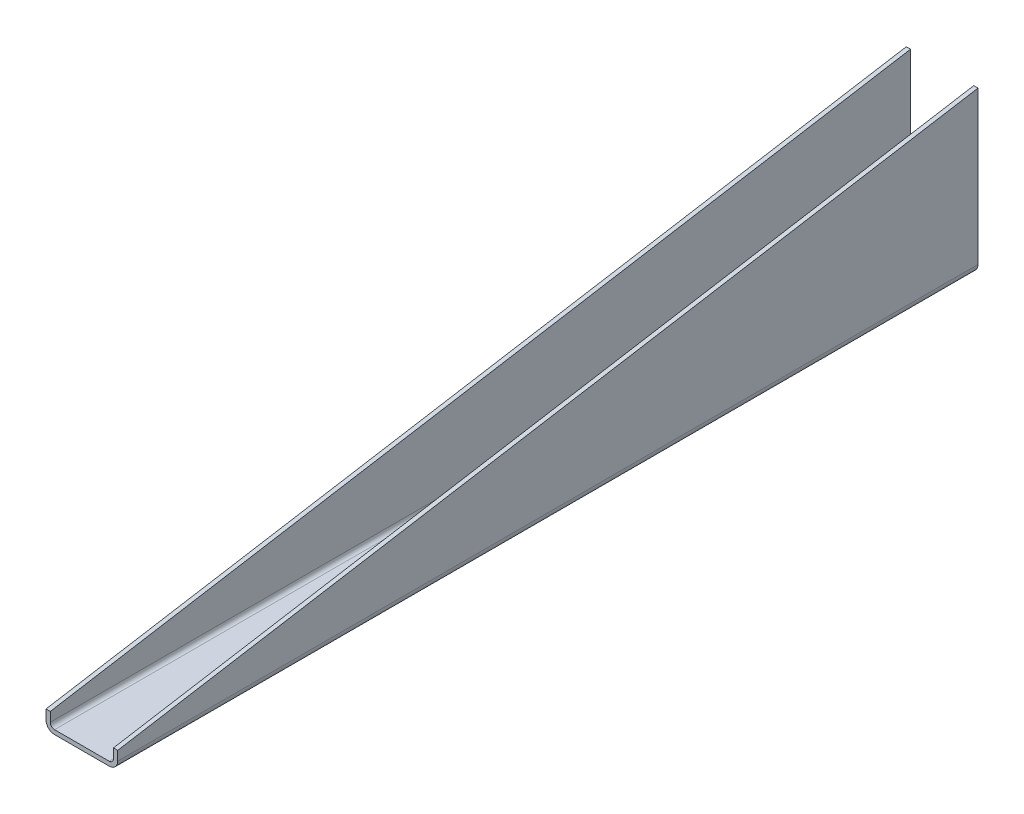
ISO-10303-21;
HEADER;
FILE_DESCRIPTION(('STEP AP214'),'2;1');
FILE_NAME('part.step','',(''),(''),'','','');
FILE_SCHEMA(('AUTOMOTIVE_DESIGN { 1 0 10303 214 1 1 1 1 }'));
ENDSEC;
DATA;
#1=APPLICATION_CONTEXT('core data for automotive mechanical design processes');
#2=APPLICATION_PROTOCOL_DEFINITION('international standard','automotive_design',2000,#1);
#3=PRODUCT_CONTEXT('',#1,'mechanical');
#4=PRODUCT('Part','Part','',(#3));
#5=PRODUCT_RELATED_PRODUCT_CATEGORY('part','',(#4));
#6=PRODUCT_DEFINITION_FORMATION('','',#4);
#7=PRODUCT_DEFINITION_CONTEXT('part definition',#1,'design');
#8=PRODUCT_DEFINITION('design','',#6,#7);
#9=PRODUCT_DEFINITION_SHAPE('','',#8);
#10=(LENGTH_UNIT() NAMED_UNIT(*) SI_UNIT(.MILLI.,.METRE.));
#11=(NAMED_UNIT(*) PLANE_ANGLE_UNIT() SI_UNIT($,.RADIAN.));
#12=(NAMED_UNIT(*) SI_UNIT($,.STERADIAN.) SOLID_ANGLE_UNIT());
#13=UNCERTAINTY_MEASURE_WITH_UNIT(LENGTH_MEASURE(1.E-05),#10,'distance_accuracy_value','');
#14=(GEOMETRIC_REPRESENTATION_CONTEXT(3) GLOBAL_UNCERTAINTY_ASSIGNED_CONTEXT((#13)) GLOBAL_UNIT_ASSIGNED_CONTEXT((#10,
#11,#12)) REPRESENTATION_CONTEXT('',''));
#15=CARTESIAN_POINT('',(0.,0.,0.));
#16=DIRECTION('',(0.,0.,1.));
#17=DIRECTION('',(1.,0.,0.));
#18=AXIS2_PLACEMENT_3D('',#15,#16,#17);
#19=CARTESIAN_POINT('',(22.3774,0.,-609.6));
#20=DIRECTION('',(1.,0.,0.));
#21=DIRECTION('',(0.,0.,-1.));
#22=AXIS2_PLACEMENT_3D('',#19,#20,#21);
#23=PLANE('',#22);
#24=DIRECTION('',(0.,0.,-1.));
#25=VECTOR('',#24,1.);
#26=CARTESIAN_POINT('',(22.3774,6.0452,0.));
#27=LINE('',#26,#25);
#28=CARTESIAN_POINT('',(22.3774,6.0452,-609.6));
#29=VERTEX_POINT('',#28);
#30=CARTESIAN_POINT('',(22.3774,6.0452,0.));
#31=VERTEX_POINT('',#30);
#32=EDGE_CURVE('E104',#29,#31,#27,.F.);
#33=ORIENTED_EDGE('',*,*,#32,.T.);
#34=DIRECTION('',(0.,1.,0.));
#35=VECTOR('',#34,1.);
#36=CARTESIAN_POINT('',(22.3774,60.1726,0.));
#37=LINE('',#36,#35);
#38=CARTESIAN_POINT('',(22.3774,12.699999999995,-8.32667268468867E-13));
#39=VERTEX_POINT('',#38);
#40=EDGE_CURVE('E145',#39,#31,#37,.F.);
#41=ORIENTED_EDGE('',*,*,#40,.F.);
#42=DIRECTION('',(0.,-0.164398987305406,0.986393923832136));
#43=VECTOR('',#42,1.);
#44=CARTESIAN_POINT('',(22.3774,63.5,-304.8));
#45=LINE('',#44,#43);
#46=CARTESIAN_POINT('',(22.3774,114.300000000005,-609.599999999999));
#47=VERTEX_POINT('',#46);
#48=EDGE_CURVE('E107',#47,#39,#45,.T.);
#49=ORIENTED_EDGE('',*,*,#48,.F.);
#50=DIRECTION('',(0.,1.,0.));
#51=VECTOR('',#50,1.);
#52=CARTESIAN_POINT('',(22.3774,60.1726,-609.6));
#53=LINE('',#52,#51);
#54=EDGE_CURVE('E102',#29,#47,#53,.T.);
#55=ORIENTED_EDGE('',*,*,#54,.F.);
#56=EDGE_LOOP('',(#33,#41,#49,#55));
#57=FACE_BOUND('',#56,.T.);
#58=ADVANCED_FACE('F17',(#57),#23,.F.);
#59=CARTESIAN_POINT('',(23.8887,63.5,-304.8));
#60=DIRECTION('',(0.,0.986393923832136,0.164398987305406));
#61=DIRECTION('',(0.,-0.164398987305406,0.986393923832136));
#62=AXIS2_PLACEMENT_3D('',#59,#60,#61);
#63=PLANE('',#62);
#64=DIRECTION('',(1.,0.,0.));
#65=VECTOR('',#64,1.);
#66=CARTESIAN_POINT('',(23.8887,12.7,0.));
#67=LINE('',#66,#65);
#68=CARTESIAN_POINT('',(25.4,12.7,0.));
#69=VERTEX_POINT('',#68);
#70=EDGE_CURVE('E121',#69,#39,#67,.F.);
#71=ORIENTED_EDGE('',*,*,#70,.F.);
#72=DIRECTION('',(0.,-0.164398987305357,0.986393923832144));
#73=VECTOR('',#72,1.);
#74=CARTESIAN_POINT('',(25.4,114.3,-609.6));
#75=LINE('',#74,#73);
#76=CARTESIAN_POINT('',(25.4,114.3,-609.6));
#77=VERTEX_POINT('',#76);
#78=EDGE_CURVE('E127',#77,#69,#75,.T.);
#79=ORIENTED_EDGE('',*,*,#78,.F.);
#80=DIRECTION('',(-1.,0.,0.));
#81=VECTOR('',#80,1.);
#82=CARTESIAN_POINT('',(23.8887,114.3,-609.6));
#83=LINE('',#82,#81);
#84=EDGE_CURVE('E111',#47,#77,#83,.F.);
#85=ORIENTED_EDGE('',*,*,#84,.F.);
#86=ORIENTED_EDGE('',*,*,#48,.T.);
#87=EDGE_LOOP('',(#71,#79,#85,#86));
#88=FACE_BOUND('',#87,.T.);
#89=ADVANCED_FACE('F196',(#88),#63,.T.);
#90=CARTESIAN_POINT('',(19.3548,6.0452,0.));
#91=DIRECTION('',(0.,0.,-1.));
#92=DIRECTION('',(-1.,0.,0.));
#93=AXIS2_PLACEMENT_3D('',#90,#91,#92);
#94=CYLINDRICAL_SURFACE('',#93,3.0226);
#95=DIRECTION('',(0.,0.,1.));
#96=VECTOR('',#95,1.);
#97=CARTESIAN_POINT('',(19.3548,3.0226,0.));
#98=LINE('',#97,#96);
#99=CARTESIAN_POINT('',(19.3548,3.0226,0.));
#100=VERTEX_POINT('',#99);
#101=CARTESIAN_POINT('',(19.3548,3.0226,-609.6));
#102=VERTEX_POINT('',#101);
#103=EDGE_CURVE('E128',#100,#102,#98,.F.);
#104=ORIENTED_EDGE('',*,*,#103,.F.);
#105=CARTESIAN_POINT('',(19.3548,6.0452,0.));
#106=DIRECTION('',(0.,0.,-1.));
#107=DIRECTION('',(-1.,0.,0.));
#108=AXIS2_PLACEMENT_3D('',#105,#106,#107);
#109=CIRCLE('',#108,3.0226);
#110=EDGE_CURVE('E119',#31,#100,#109,.T.);
#111=ORIENTED_EDGE('',*,*,#110,.F.);
#112=ORIENTED_EDGE('',*,*,#32,.F.);
#113=CARTESIAN_POINT('',(19.3548,6.0452,-609.6));
#114=DIRECTION('',(0.,0.,-1.));
#115=DIRECTION('',(-1.,0.,0.));
#116=AXIS2_PLACEMENT_3D('',#113,#114,#115);
#117=CIRCLE('',#116,3.0226);
#118=EDGE_CURVE('E20',#29,#102,#117,.T.);
#119=ORIENTED_EDGE('',*,*,#118,.T.);
#120=EDGE_LOOP('',(#104,#111,#112,#119));
#121=FACE_BOUND('',#120,.T.);
#122=ADVANCED_FACE('F116',(#121),#94,.F.);
#123=CARTESIAN_POINT('',(25.4,0.,-609.6));
#124=DIRECTION('',(1.,0.,0.));
#125=DIRECTION('',(0.,0.,-1.));
#126=AXIS2_PLACEMENT_3D('',#123,#124,#125);
#127=PLANE('',#126);
#128=DIRECTION('',(0.,1.,0.));
#129=VECTOR('',#128,1.);
#130=CARTESIAN_POINT('',(25.4,0.,-609.6));
#131=LINE('',#130,#129);
#132=CARTESIAN_POINT('',(25.4,6.0452,-609.6));
#133=VERTEX_POINT('',#132);
#134=EDGE_CURVE('E130',#133,#77,#131,.T.);
#135=ORIENTED_EDGE('',*,*,#134,.T.);
#136=ORIENTED_EDGE('',*,*,#78,.T.);
#137=DIRECTION('',(0.,1.,0.));
#138=VECTOR('',#137,1.);
#139=CARTESIAN_POINT('',(25.4,0.,0.));
#140=LINE('',#139,#138);
#141=CARTESIAN_POINT('',(25.4,6.0452,0.));
#142=VERTEX_POINT('',#141);
#143=EDGE_CURVE('E120',#69,#142,#140,.F.);
#144=ORIENTED_EDGE('',*,*,#143,.T.);
#145=DIRECTION('',(0.,0.,-1.));
#146=VECTOR('',#145,1.);
#147=CARTESIAN_POINT('',(25.4,6.0452,0.));
#148=LINE('',#147,#146);
#149=EDGE_CURVE('E171',#133,#142,#148,.F.);
#150=ORIENTED_EDGE('',*,*,#149,.F.);
#151=EDGE_LOOP('',(#135,#136,#144,#150));
#152=FACE_BOUND('',#151,.T.);
#153=ADVANCED_FACE('F198',(#152),#127,.T.);
#154=CARTESIAN_POINT('',(0.,3.0226,0.));
#155=DIRECTION('',(0.,1.,0.));
#156=DIRECTION('',(0.,0.,1.));
#157=AXIS2_PLACEMENT_3D('',#154,#155,#156);
#158=PLANE('',#157);
#159=DIRECTION('',(0.,0.,1.));
#160=VECTOR('',#159,1.);
#161=CARTESIAN_POINT('',(-19.3548,3.0226,-609.6));
#162=LINE('',#161,#160);
#163=CARTESIAN_POINT('',(-19.3548,3.0226,-609.6));
#164=VERTEX_POINT('',#163);
#165=CARTESIAN_POINT('',(-19.3548,3.0226,0.));
#166=VERTEX_POINT('',#165);
#167=EDGE_CURVE('E167',#164,#166,#162,.T.);
#168=ORIENTED_EDGE('',*,*,#167,.T.);
#169=DIRECTION('',(-1.,0.,0.));
#170=VECTOR('',#169,1.);
#171=CARTESIAN_POINT('',(0.,3.0226,0.));
#172=LINE('',#171,#170);
#173=EDGE_CURVE('E238',#166,#100,#172,.F.);
#174=ORIENTED_EDGE('',*,*,#173,.T.);
#175=ORIENTED_EDGE('',*,*,#103,.T.);
#176=DIRECTION('',(1.,0.,0.));
#177=VECTOR('',#176,1.);
#178=CARTESIAN_POINT('',(0.,3.0226,-609.6));
#179=LINE('',#178,#177);
#180=EDGE_CURVE('E126',#102,#164,#179,.F.);
#181=ORIENTED_EDGE('',*,*,#180,.T.);
#182=EDGE_LOOP('',(#168,#174,#175,#181));
#183=FACE_BOUND('',#182,.T.);
#184=ADVANCED_FACE('F327',(#183),#158,.T.);
#185=CARTESIAN_POINT('',(19.3548,6.0452,0.));
#186=DIRECTION('',(0.,0.,-1.));
#187=DIRECTION('',(-1.,0.,0.));
#188=AXIS2_PLACEMENT_3D('',#185,#186,#187);
#189=CYLINDRICAL_SURFACE('',#188,6.0452);
#190=CARTESIAN_POINT('',(19.3548,6.0452,-609.6));
#191=DIRECTION('',(0.,0.,-1.));
#192=DIRECTION('',(-1.,0.,0.));
#193=AXIS2_PLACEMENT_3D('',#190,#191,#192);
#194=CIRCLE('',#193,6.0452);
#195=CARTESIAN_POINT('',(19.3548,0.,-609.6));
#196=VERTEX_POINT('',#195);
#197=EDGE_CURVE('E168',#196,#133,#194,.F.);
#198=ORIENTED_EDGE('',*,*,#197,.T.);
#199=ORIENTED_EDGE('',*,*,#149,.T.);
#200=CARTESIAN_POINT('',(19.3548,6.0452,0.));
#201=DIRECTION('',(0.,0.,-1.));
#202=DIRECTION('',(-1.,0.,0.));
#203=AXIS2_PLACEMENT_3D('',#200,#201,#202);
#204=CIRCLE('',#203,6.0452);
#205=CARTESIAN_POINT('',(19.3548,0.,0.));
#206=VERTEX_POINT('',#205);
#207=EDGE_CURVE('E172',#142,#206,#204,.T.);
#208=ORIENTED_EDGE('',*,*,#207,.T.);
#209=DIRECTION('',(0.,0.,1.));
#210=VECTOR('',#209,1.);
#211=CARTESIAN_POINT('',(19.3548,0.,0.));
#212=LINE('',#211,#210);
#213=EDGE_CURVE('E200',#206,#196,#212,.F.);
#214=ORIENTED_EDGE('',*,*,#213,.T.);
#215=EDGE_LOOP('',(#198,#199,#208,#214));
#216=FACE_BOUND('',#215,.T.);
#217=ADVANCED_FACE('F199',(#216),#189,.T.);
#218=CARTESIAN_POINT('',(-19.3548,6.0452,-609.6));
#219=DIRECTION('',(0.,0.,1.));
#220=DIRECTION('',(1.,0.,0.));
#221=AXIS2_PLACEMENT_3D('',#218,#219,#220);
#222=CYLINDRICAL_SURFACE('',#221,3.0226);
#223=ORIENTED_EDGE('',*,*,#167,.F.);
#224=CARTESIAN_POINT('',(-19.3548,6.0452,-609.6));
#225=DIRECTION('',(0.,0.,1.));
#226=DIRECTION('',(1.,0.,0.));
#227=AXIS2_PLACEMENT_3D('',#224,#225,#226);
#228=CIRCLE('',#227,3.0226);
#229=CARTESIAN_POINT('',(-22.3774,6.0452,-609.6));
#230=VERTEX_POINT('',#229);
#231=EDGE_CURVE('E164',#230,#164,#228,.T.);
#232=ORIENTED_EDGE('',*,*,#231,.F.);
#233=DIRECTION('',(0.,0.,1.));
#234=VECTOR('',#233,1.);
#235=CARTESIAN_POINT('',(-22.3774,6.0452,0.));
#236=LINE('',#235,#234);
#237=CARTESIAN_POINT('',(-22.3774,6.0452,0.));
#238=VERTEX_POINT('',#237);
#239=EDGE_CURVE('E162',#230,#238,#236,.T.);
#240=ORIENTED_EDGE('',*,*,#239,.T.);
#241=CARTESIAN_POINT('',(-19.3548,6.0452,0.));
#242=DIRECTION('',(0.,0.,1.));
#243=DIRECTION('',(1.,0.,0.));
#244=AXIS2_PLACEMENT_3D('',#241,#242,#243);
#245=CIRCLE('',#244,3.0226);
#246=EDGE_CURVE('E159',#238,#166,#245,.T.);
#247=ORIENTED_EDGE('',*,*,#246,.T.);
#248=EDGE_LOOP('',(#223,#232,#240,#247));
#249=FACE_BOUND('',#248,.T.);
#250=ADVANCED_FACE('F309',(#249),#222,.F.);
#251=CARTESIAN_POINT('',(0.,0.,0.));
#252=DIRECTION('',(0.,1.,0.));
#253=DIRECTION('',(0.,0.,1.));
#254=AXIS2_PLACEMENT_3D('',#251,#252,#253);
#255=PLANE('',#254);
#256=DIRECTION('',(1.,0.,0.));
#257=VECTOR('',#256,1.);
#258=CARTESIAN_POINT('',(0.,0.,-609.6));
#259=LINE('',#258,#257);
#260=CARTESIAN_POINT('',(-19.3548,0.,-609.6));
#261=VERTEX_POINT('',#260);
#262=EDGE_CURVE('E163',#196,#261,#259,.F.);
#263=ORIENTED_EDGE('',*,*,#262,.F.);
#264=ORIENTED_EDGE('',*,*,#213,.F.);
#265=DIRECTION('',(1.,0.,0.));
#266=VECTOR('',#265,1.);
#267=CARTESIAN_POINT('',(0.,0.,0.));
#268=LINE('',#267,#266);
#269=CARTESIAN_POINT('',(-19.3548,0.,0.));
#270=VERTEX_POINT('',#269);
#271=EDGE_CURVE('E166',#270,#206,#268,.T.);
#272=ORIENTED_EDGE('',*,*,#271,.F.);
#273=DIRECTION('',(0.,0.,1.));
#274=VECTOR('',#273,1.);
#275=CARTESIAN_POINT('',(-19.3548,0.,-609.6));
#276=LINE('',#275,#274);
#277=EDGE_CURVE('E154',#261,#270,#276,.T.);
#278=ORIENTED_EDGE('',*,*,#277,.F.);
#279=EDGE_LOOP('',(#263,#264,#272,#278));
#280=FACE_BOUND('',#279,.T.);
#281=ADVANCED_FACE('F207',(#280),#255,.F.);
#282=CARTESIAN_POINT('',(-22.3774,0.,0.));
#283=DIRECTION('',(-1.,0.,0.));
#284=DIRECTION('',(0.,0.,1.));
#285=AXIS2_PLACEMENT_3D('',#282,#283,#284);
#286=PLANE('',#285);
#287=ORIENTED_EDGE('',*,*,#239,.F.);
#288=DIRECTION('',(0.,1.,0.));
#289=VECTOR('',#288,1.);
#290=CARTESIAN_POINT('',(-22.3774,60.1726,-609.6));
#291=LINE('',#290,#289);
#292=CARTESIAN_POINT('',(-22.3774,114.300000000004,-609.6));
#293=VERTEX_POINT('',#292);
#294=EDGE_CURVE('E158',#293,#230,#291,.F.);
#295=ORIENTED_EDGE('',*,*,#294,.F.);
#296=DIRECTION('',(0.,-0.164398987305406,0.986393923832136));
#297=VECTOR('',#296,1.);
#298=CARTESIAN_POINT('',(-22.3774,63.5,-304.8));
#299=LINE('',#298,#297);
#300=CARTESIAN_POINT('',(-22.3774,12.6999999999962,-6.24500451351651E-13));
#301=VERTEX_POINT('',#300);
#302=EDGE_CURVE('E224',#301,#293,#299,.F.);
#303=ORIENTED_EDGE('',*,*,#302,.F.);
#304=DIRECTION('',(0.,1.,0.));
#305=VECTOR('',#304,1.);
#306=CARTESIAN_POINT('',(-22.3774,60.1726,0.));
#307=LINE('',#306,#305);
#308=EDGE_CURVE('E153',#238,#301,#307,.T.);
#309=ORIENTED_EDGE('',*,*,#308,.F.);
#310=EDGE_LOOP('',(#287,#295,#303,#309));
#311=FACE_BOUND('',#310,.T.);
#312=ADVANCED_FACE('F291',(#311),#286,.F.);
#313=CARTESIAN_POINT('',(-23.8887,60.1726,-609.6));
#314=DIRECTION('',(0.,0.,-1.));
#315=DIRECTION('',(-1.,0.,0.));
#316=AXIS2_PLACEMENT_3D('',#313,#314,#315);
#317=PLANE('',#316);
#318=DIRECTION('',(0.,1.,0.));
#319=VECTOR('',#318,1.);
#320=CARTESIAN_POINT('',(-25.4,0.,-609.6));
#321=LINE('',#320,#319);
#322=CARTESIAN_POINT('',(-25.4,114.300000000004,-609.599999999999));
#323=VERTEX_POINT('',#322);
#324=CARTESIAN_POINT('',(-25.4,6.0452,-609.6));
#325=VERTEX_POINT('',#324);
#326=EDGE_CURVE('E217',#323,#325,#321,.F.);
#327=ORIENTED_EDGE('',*,*,#326,.F.);
#328=DIRECTION('',(1.,0.,0.));
#329=VECTOR('',#328,1.);
#330=CARTESIAN_POINT('',(-23.8887,114.300000000015,-609.599999999998));
#331=LINE('',#330,#329);
#332=EDGE_CURVE('E222',#293,#323,#331,.F.);
#333=ORIENTED_EDGE('',*,*,#332,.F.);
#334=ORIENTED_EDGE('',*,*,#294,.T.);
#335=ORIENTED_EDGE('',*,*,#231,.T.);
#336=ORIENTED_EDGE('',*,*,#180,.F.);
#337=ORIENTED_EDGE('',*,*,#118,.F.);
#338=ORIENTED_EDGE('',*,*,#54,.T.);
#339=ORIENTED_EDGE('',*,*,#84,.T.);
#340=ORIENTED_EDGE('',*,*,#134,.F.);
#341=ORIENTED_EDGE('',*,*,#197,.F.);
#342=ORIENTED_EDGE('',*,*,#262,.T.);
#343=CARTESIAN_POINT('',(-19.3548,6.0452,-609.6));
#344=DIRECTION('',(0.,0.,1.));
#345=DIRECTION('',(1.,0.,0.));
#346=AXIS2_PLACEMENT_3D('',#343,#344,#345);
#347=CIRCLE('',#346,6.0452);
#348=EDGE_CURVE('E155',#325,#261,#347,.T.);
#349=ORIENTED_EDGE('',*,*,#348,.F.);
#350=EDGE_LOOP('',(#327,#333,#334,#335,#336,#337,#338,#339,#340,#341,#342,#349));
#351=FACE_BOUND('',#350,.T.);
#352=ADVANCED_FACE('F124',(#351),#317,.T.);
#353=CARTESIAN_POINT('',(-19.3548,6.0452,-609.6));
#354=DIRECTION('',(0.,0.,1.));
#355=DIRECTION('',(1.,0.,0.));
#356=AXIS2_PLACEMENT_3D('',#353,#354,#355);
#357=CYLINDRICAL_SURFACE('',#356,6.0452);
#358=CARTESIAN_POINT('',(-19.3548,6.0452,0.));
#359=DIRECTION('',(0.,0.,1.));
#360=DIRECTION('',(1.,0.,0.));
#361=AXIS2_PLACEMENT_3D('',#358,#359,#360);
#362=CIRCLE('',#361,6.0452);
#363=CARTESIAN_POINT('',(-25.4,6.0452,0.));
#364=VERTEX_POINT('',#363);
#365=EDGE_CURVE('E151',#270,#364,#362,.F.);
#366=ORIENTED_EDGE('',*,*,#365,.T.);
#367=DIRECTION('',(0.,0.,1.));
#368=VECTOR('',#367,1.);
#369=CARTESIAN_POINT('',(-25.4,6.0452,0.));
#370=LINE('',#369,#368);
#371=EDGE_CURVE('E213',#325,#364,#370,.T.);
#372=ORIENTED_EDGE('',*,*,#371,.F.);
#373=ORIENTED_EDGE('',*,*,#348,.T.);
#374=ORIENTED_EDGE('',*,*,#277,.T.);
#375=EDGE_LOOP('',(#366,#372,#373,#374));
#376=FACE_BOUND('',#375,.T.);
#377=ADVANCED_FACE('F211',(#376),#357,.T.);
#378=CARTESIAN_POINT('',(-23.8887,60.1726,0.));
#379=DIRECTION('',(0.,0.,1.));
#380=DIRECTION('',(1.,0.,0.));
#381=AXIS2_PLACEMENT_3D('',#378,#379,#380);
#382=PLANE('',#381);
#383=ORIENTED_EDGE('',*,*,#308,.T.);
#384=DIRECTION('',(1.,0.,0.));
#385=VECTOR('',#384,1.);
#386=CARTESIAN_POINT('',(-23.8887,12.699999999985,-2.4980018054066E-12));
#387=LINE('',#386,#385);
#388=CARTESIAN_POINT('',(-25.4,12.6999999999962,-6.24500451351651E-13));
#389=VERTEX_POINT('',#388);
#390=EDGE_CURVE('E35',#389,#301,#387,.T.);
#391=ORIENTED_EDGE('',*,*,#390,.F.);
#392=DIRECTION('',(0.,1.,0.));
#393=VECTOR('',#392,1.);
#394=CARTESIAN_POINT('',(-25.4,0.,0.));
#395=LINE('',#394,#393);
#396=EDGE_CURVE('E26',#364,#389,#395,.T.);
#397=ORIENTED_EDGE('',*,*,#396,.F.);
#398=ORIENTED_EDGE('',*,*,#365,.F.);
#399=ORIENTED_EDGE('',*,*,#271,.T.);
#400=ORIENTED_EDGE('',*,*,#207,.F.);
#401=ORIENTED_EDGE('',*,*,#143,.F.);
#402=ORIENTED_EDGE('',*,*,#70,.T.);
#403=ORIENTED_EDGE('',*,*,#40,.T.);
#404=ORIENTED_EDGE('',*,*,#110,.T.);
#405=ORIENTED_EDGE('',*,*,#173,.F.);
#406=ORIENTED_EDGE('',*,*,#246,.F.);
#407=EDGE_LOOP('',(#383,#391,#397,#398,#399,#400,#401,#402,#403,#404,#405,#406));
#408=FACE_BOUND('',#407,.T.);
#409=ADVANCED_FACE('F247',(#408),#382,.T.);
#410=CARTESIAN_POINT('',(-23.8887,63.5,-304.8));
#411=DIRECTION('',(0.,0.986393923832136,0.164398987305406));
#412=DIRECTION('',(0.,-0.164398987305406,0.986393923832136));
#413=AXIS2_PLACEMENT_3D('',#410,#411,#412);
#414=PLANE('',#413);
#415=ORIENTED_EDGE('',*,*,#332,.T.);
#416=DIRECTION('',(0.,0.164398987305357,-0.986393923832144));
#417=VECTOR('',#416,1.);
#418=CARTESIAN_POINT('',(-25.4,12.7,0.));
#419=LINE('',#418,#417);
#420=EDGE_CURVE('E11',#389,#323,#419,.T.);
#421=ORIENTED_EDGE('',*,*,#420,.F.);
#422=ORIENTED_EDGE('',*,*,#390,.T.);
#423=ORIENTED_EDGE('',*,*,#302,.T.);
#424=EDGE_LOOP('',(#415,#421,#422,#423));
#425=FACE_BOUND('',#424,.T.);
#426=ADVANCED_FACE('F245',(#425),#414,.T.);
#427=CARTESIAN_POINT('',(-25.4,0.,0.));
#428=DIRECTION('',(-1.,0.,0.));
#429=DIRECTION('',(0.,0.,1.));
#430=AXIS2_PLACEMENT_3D('',#427,#428,#429);
#431=PLANE('',#430);
#432=ORIENTED_EDGE('',*,*,#396,.T.);
#433=ORIENTED_EDGE('',*,*,#420,.T.);
#434=ORIENTED_EDGE('',*,*,#326,.T.);
#435=ORIENTED_EDGE('',*,*,#371,.T.);
#436=EDGE_LOOP('',(#432,#433,#434,#435));
#437=FACE_BOUND('',#436,.T.);
#438=ADVANCED_FACE('F219',(#437),#431,.T.);
#439=CLOSED_SHELL('',(#58,#89,#122,#153,#184,#217,#250,#281,#312,#352,#377,#409,#426,#438));
#440=MANIFOLD_SOLID_BREP('B1',#439);
#441=ADVANCED_BREP_SHAPE_REPRESENTATION('',(#18,#440),#14);
#442=SHAPE_DEFINITION_REPRESENTATION(#9,#441);
ENDSEC;
END-ISO-10303-21;
